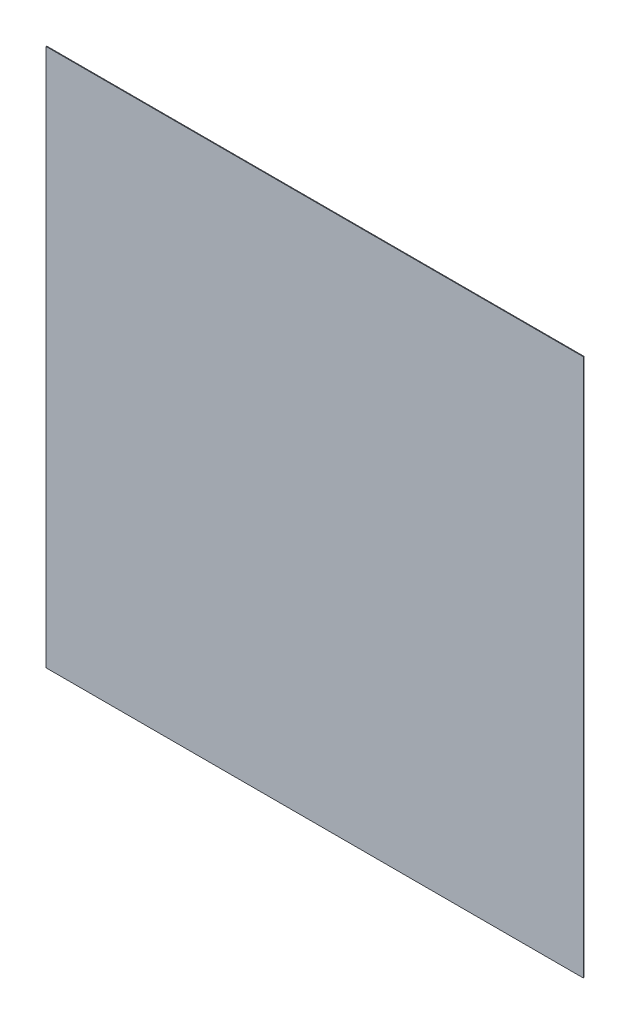
ISO-10303-21;
HEADER;
FILE_DESCRIPTION(('STEP AP214'),'2;1');
FILE_NAME('part.step','',(''),(''),'','','');
FILE_SCHEMA(('AUTOMOTIVE_DESIGN { 1 0 10303 214 1 1 1 1 }'));
ENDSEC;
DATA;
#1=APPLICATION_CONTEXT('core data for automotive mechanical design processes');
#2=APPLICATION_PROTOCOL_DEFINITION('international standard','automotive_design',2000,#1);
#3=PRODUCT_CONTEXT('',#1,'mechanical');
#4=PRODUCT('Part','Part','',(#3));
#5=PRODUCT_RELATED_PRODUCT_CATEGORY('part','',(#4));
#6=PRODUCT_DEFINITION_FORMATION('','',#4);
#7=PRODUCT_DEFINITION_CONTEXT('part definition',#1,'design');
#8=PRODUCT_DEFINITION('design','',#6,#7);
#9=PRODUCT_DEFINITION_SHAPE('','',#8);
#10=(LENGTH_UNIT() NAMED_UNIT(*) SI_UNIT(.MILLI.,.METRE.));
#11=(NAMED_UNIT(*) PLANE_ANGLE_UNIT() SI_UNIT($,.RADIAN.));
#12=(NAMED_UNIT(*) SI_UNIT($,.STERADIAN.) SOLID_ANGLE_UNIT());
#13=UNCERTAINTY_MEASURE_WITH_UNIT(LENGTH_MEASURE(1.E-05),#10,'distance_accuracy_value','');
#14=(GEOMETRIC_REPRESENTATION_CONTEXT(3) GLOBAL_UNCERTAINTY_ASSIGNED_CONTEXT((#13)) GLOBAL_UNIT_ASSIGNED_CONTEXT((#10,
#11,#12)) REPRESENTATION_CONTEXT('',''));
#15=CARTESIAN_POINT('',(0.,0.,0.));
#16=DIRECTION('',(0.,0.,1.));
#17=DIRECTION('',(1.,0.,0.));
#18=AXIS2_PLACEMENT_3D('',#15,#16,#17);
#19=CARTESIAN_POINT('',(-1.649856312775E-05,-2.984207743418E-05,0.00100076));
#20=DIRECTION('',(0.,0.,1.));
#21=DIRECTION('',(1.,0.,0.));
#22=AXIS2_PLACEMENT_3D('',#19,#20,#21);
#23=PLANE('',#22);
#24=DIRECTION('',(6.67855448561799E-06,0.999999999977698,0.));
#25=VECTOR('',#24,1.);
#26=CARTESIAN_POINT('',(0.37977826,-0.38038278,0.00100076));
#27=LINE('',#26,#25);
#28=CARTESIAN_POINT('',(0.37977826,-0.38038278,0.00100076));
#29=VERTEX_POINT('',#28);
#30=CARTESIAN_POINT('',(0.37978334,0.38026086,0.00100076));
#31=VERTEX_POINT('',#30);
#32=EDGE_CURVE('E82',#29,#31,#27,.T.);
#33=ORIENTED_EDGE('',*,*,#32,.T.);
#34=DIRECTION('',(-0.999999987117858,0.000160512568070277,0.));
#35=VECTOR('',#34,1.);
#36=CARTESIAN_POINT('',(0.37978334,0.38026086,0.00100076));
#37=LINE('',#36,#35);
#38=CARTESIAN_POINT('',(-0.37978334,0.38038278,0.00100076));
#39=VERTEX_POINT('',#38);
#40=EDGE_CURVE('E107',#31,#39,#37,.T.);
#41=ORIENTED_EDGE('',*,*,#40,.T.);
#42=DIRECTION('',(0.,-1.,0.));
#43=VECTOR('',#42,1.);
#44=CARTESIAN_POINT('',(-0.37978334,0.38038278,0.00100076));
#45=LINE('',#44,#43);
#46=CARTESIAN_POINT('',(-0.37978334,-0.38038278,0.00100076));
#47=VERTEX_POINT('',#46);
#48=EDGE_CURVE('E75',#39,#47,#45,.T.);
#49=ORIENTED_EDGE('',*,*,#48,.T.);
#50=DIRECTION('',(1.,0.,0.));
#51=VECTOR('',#50,1.);
#52=CARTESIAN_POINT('',(-0.37978334,-0.38038278,0.00100076));
#53=LINE('',#52,#51);
#54=EDGE_CURVE('E11',#47,#29,#53,.T.);
#55=ORIENTED_EDGE('',*,*,#54,.T.);
#56=EDGE_LOOP('',(#33,#41,#49,#55));
#57=FACE_BOUND('',#56,.T.);
#58=ADVANCED_FACE('F17',(#57),#23,.T.);
#59=CARTESIAN_POINT('',(-1.649856312775E-05,-2.984207743418E-05,0.));
#60=DIRECTION('',(0.,0.,1.));
#61=DIRECTION('',(1.,0.,0.));
#62=AXIS2_PLACEMENT_3D('',#59,#60,#61);
#63=PLANE('',#62);
#64=DIRECTION('',(1.,0.,0.));
#65=VECTOR('',#64,1.);
#66=CARTESIAN_POINT('',(-0.37978334,-0.38038278,0.));
#67=LINE('',#66,#65);
#68=CARTESIAN_POINT('',(-0.37978334,-0.38038278,0.));
#69=VERTEX_POINT('',#68);
#70=CARTESIAN_POINT('',(0.37977826,-0.38038278,0.));
#71=VERTEX_POINT('',#70);
#72=EDGE_CURVE('E20',#69,#71,#67,.T.);
#73=ORIENTED_EDGE('',*,*,#72,.F.);
#74=DIRECTION('',(0.,-1.,0.));
#75=VECTOR('',#74,1.);
#76=CARTESIAN_POINT('',(-0.37978334,0.38038278,0.));
#77=LINE('',#76,#75);
#78=CARTESIAN_POINT('',(-0.37978334,0.38038278,0.));
#79=VERTEX_POINT('',#78);
#80=EDGE_CURVE('E100',#79,#69,#77,.T.);
#81=ORIENTED_EDGE('',*,*,#80,.F.);
#82=DIRECTION('',(-0.999999987117858,0.000160512568070277,0.));
#83=VECTOR('',#82,1.);
#84=CARTESIAN_POINT('',(0.37978334,0.38026086,0.));
#85=LINE('',#84,#83);
#86=CARTESIAN_POINT('',(0.37978334,0.38026086,0.));
#87=VERTEX_POINT('',#86);
#88=EDGE_CURVE('E84',#87,#79,#85,.T.);
#89=ORIENTED_EDGE('',*,*,#88,.F.);
#90=DIRECTION('',(6.67855448561799E-06,0.999999999977698,0.));
#91=VECTOR('',#90,1.);
#92=CARTESIAN_POINT('',(0.37977826,-0.38038278,0.));
#93=LINE('',#92,#91);
#94=EDGE_CURVE('E80',#71,#87,#93,.T.);
#95=ORIENTED_EDGE('',*,*,#94,.F.);
#96=EDGE_LOOP('',(#73,#81,#89,#95));
#97=FACE_BOUND('',#96,.T.);
#98=ADVANCED_FACE('F86',(#97),#63,.F.);
#99=CARTESIAN_POINT('',(-0.37978334,-0.38038278,0.));
#100=DIRECTION('',(0.,1.,0.));
#101=DIRECTION('',(1.,0.,0.));
#102=AXIS2_PLACEMENT_3D('',#99,#100,#101);
#103=PLANE('',#102);
#104=ORIENTED_EDGE('',*,*,#72,.T.);
#105=DIRECTION('',(0.,0.,1.));
#106=VECTOR('',#105,1.);
#107=CARTESIAN_POINT('',(0.37977826,-0.38038278,0.));
#108=LINE('',#107,#106);
#109=EDGE_CURVE('E69',#71,#29,#108,.T.);
#110=ORIENTED_EDGE('',*,*,#109,.T.);
#111=ORIENTED_EDGE('',*,*,#54,.F.);
#112=DIRECTION('',(0.,0.,1.));
#113=VECTOR('',#112,1.);
#114=CARTESIAN_POINT('',(-0.37978334,-0.38038278,0.));
#115=LINE('',#114,#113);
#116=EDGE_CURVE('E72',#69,#47,#115,.T.);
#117=ORIENTED_EDGE('',*,*,#116,.F.);
#118=EDGE_LOOP('',(#104,#110,#111,#117));
#119=FACE_BOUND('',#118,.T.);
#120=ADVANCED_FACE('F68',(#119),#103,.F.);
#121=CARTESIAN_POINT('',(-0.37978334,0.38038278,0.));
#122=DIRECTION('',(1.,0.,0.));
#123=DIRECTION('',(0.,1.,0.));
#124=AXIS2_PLACEMENT_3D('',#121,#122,#123);
#125=PLANE('',#124);
#126=ORIENTED_EDGE('',*,*,#80,.T.);
#127=ORIENTED_EDGE('',*,*,#116,.T.);
#128=ORIENTED_EDGE('',*,*,#48,.F.);
#129=DIRECTION('',(0.,0.,1.));
#130=VECTOR('',#129,1.);
#131=CARTESIAN_POINT('',(-0.37978334,0.38038278,0.));
#132=LINE('',#131,#130);
#133=EDGE_CURVE('E102',#79,#39,#132,.T.);
#134=ORIENTED_EDGE('',*,*,#133,.F.);
#135=EDGE_LOOP('',(#126,#127,#128,#134));
#136=FACE_BOUND('',#135,.T.);
#137=ADVANCED_FACE('F117',(#136),#125,.F.);
#138=CARTESIAN_POINT('',(0.37978334,0.38026086,0.));
#139=DIRECTION('',(-0.000160512568070277,-0.999999987117858,0.));
#140=DIRECTION('',(-0.999999987117858,0.000160512568070277,0.));
#141=AXIS2_PLACEMENT_3D('',#138,#139,#140);
#142=PLANE('',#141);
#143=ORIENTED_EDGE('',*,*,#88,.T.);
#144=ORIENTED_EDGE('',*,*,#133,.T.);
#145=ORIENTED_EDGE('',*,*,#40,.F.);
#146=DIRECTION('',(0.,0.,1.));
#147=VECTOR('',#146,1.);
#148=CARTESIAN_POINT('',(0.37978334,0.38026086,0.));
#149=LINE('',#148,#147);
#150=EDGE_CURVE('E90',#87,#31,#149,.T.);
#151=ORIENTED_EDGE('',*,*,#150,.F.);
#152=EDGE_LOOP('',(#143,#144,#145,#151));
#153=FACE_BOUND('',#152,.T.);
#154=ADVANCED_FACE('F119',(#153),#142,.F.);
#155=CARTESIAN_POINT('',(0.37977826,-0.38038278,0.));
#156=DIRECTION('',(-0.999999999977698,6.67855448561799E-06,0.));
#157=DIRECTION('',(0.,0.,1.));
#158=AXIS2_PLACEMENT_3D('',#155,#156,#157);
#159=PLANE('',#158);
#160=ORIENTED_EDGE('',*,*,#94,.T.);
#161=ORIENTED_EDGE('',*,*,#150,.T.);
#162=ORIENTED_EDGE('',*,*,#32,.F.);
#163=ORIENTED_EDGE('',*,*,#109,.F.);
#164=EDGE_LOOP('',(#160,#161,#162,#163));
#165=FACE_BOUND('',#164,.T.);
#166=ADVANCED_FACE('F78',(#165),#159,.F.);
#167=CLOSED_SHELL('',(#58,#98,#120,#137,#154,#166));
#168=MANIFOLD_SOLID_BREP('B1',#167);
#169=ADVANCED_BREP_SHAPE_REPRESENTATION('',(#18,#168),#14);
#170=SHAPE_DEFINITION_REPRESENTATION(#9,#169);
ENDSEC;
END-ISO-10303-21;
